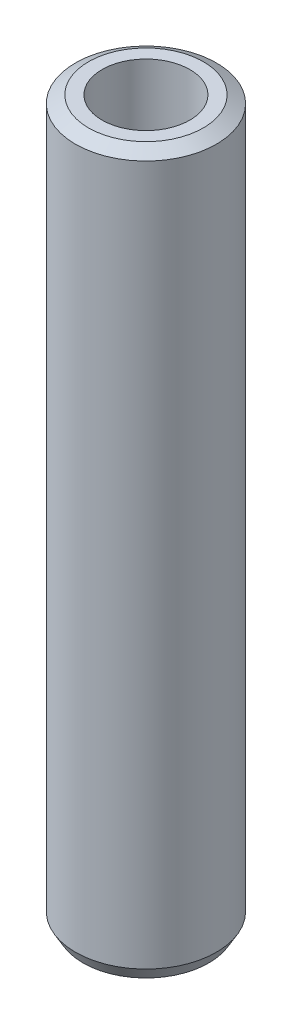
ISO-10303-21;
HEADER;
FILE_DESCRIPTION(('STEP AP214'),'2;1');
FILE_NAME('part.step','',(''),(''),'','','');
FILE_SCHEMA(('AUTOMOTIVE_DESIGN { 1 0 10303 214 1 1 1 1 }'));
ENDSEC;
DATA;
#1=APPLICATION_CONTEXT('core data for automotive mechanical design processes');
#2=APPLICATION_PROTOCOL_DEFINITION('international standard','automotive_design',2000,#1);
#3=PRODUCT_CONTEXT('',#1,'mechanical');
#4=PRODUCT('Part','Part','',(#3));
#5=PRODUCT_RELATED_PRODUCT_CATEGORY('part','',(#4));
#6=PRODUCT_DEFINITION_FORMATION('','',#4);
#7=PRODUCT_DEFINITION_CONTEXT('part definition',#1,'design');
#8=PRODUCT_DEFINITION('design','',#6,#7);
#9=PRODUCT_DEFINITION_SHAPE('','',#8);
#10=(LENGTH_UNIT() NAMED_UNIT(*) SI_UNIT(.MILLI.,.METRE.));
#11=(NAMED_UNIT(*) PLANE_ANGLE_UNIT() SI_UNIT($,.RADIAN.));
#12=(NAMED_UNIT(*) SI_UNIT($,.STERADIAN.) SOLID_ANGLE_UNIT());
#13=UNCERTAINTY_MEASURE_WITH_UNIT(LENGTH_MEASURE(1.E-05),#10,'distance_accuracy_value','');
#14=(GEOMETRIC_REPRESENTATION_CONTEXT(3) GLOBAL_UNCERTAINTY_ASSIGNED_CONTEXT((#13)) GLOBAL_UNIT_ASSIGNED_CONTEXT((#10,
#11,#12)) REPRESENTATION_CONTEXT('',''));
#15=CARTESIAN_POINT('',(0.,0.,0.));
#16=DIRECTION('',(0.,0.,1.));
#17=DIRECTION('',(1.,0.,0.));
#18=AXIS2_PLACEMENT_3D('',#15,#16,#17);
#19=CARTESIAN_POINT('',(0.,408.854899427653,0.));
#20=DIRECTION('',(0.,-1.,0.));
#21=DIRECTION('',(0.,0.,-1.));
#22=AXIS2_PLACEMENT_3D('',#19,#20,#21);
#23=CYLINDRICAL_SURFACE('',#22,40.);
#24=CARTESIAN_POINT('',(0.,404.567432855086,0.));
#25=DIRECTION('',(0.,1.,0.));
#26=DIRECTION('',(0.,0.,1.));
#27=AXIS2_PLACEMENT_3D('',#24,#25,#26);
#28=CIRCLE('',#27,40.);
#29=CARTESIAN_POINT('',(0.,404.567432855086,40.));
#30=VERTEX_POINT('',#29);
#31=EDGE_CURVE('E50',#30,#30,#28,.F.);
#32=ORIENTED_EDGE('',*,*,#31,.T.);
#33=EDGE_LOOP('',(#32));
#34=FACE_BOUND('',#33,.T.);
#35=CARTESIAN_POINT('',(0.,7.42610993943815,0.));
#36=DIRECTION('',(0.,1.,0.));
#37=DIRECTION('',(0.,0.,1.));
#38=AXIS2_PLACEMENT_3D('',#35,#36,#37);
#39=CIRCLE('',#38,40.);
#40=CARTESIAN_POINT('',(0.,7.42610993943815,40.));
#41=VERTEX_POINT('',#40);
#42=EDGE_CURVE('E51',#41,#41,#39,.T.);
#43=ORIENTED_EDGE('',*,*,#42,.T.);
#44=EDGE_LOOP('',(#43));
#45=FACE_BOUND('',#44,.T.);
#46=ADVANCED_FACE('F39',(#34,#45),#23,.T.);
#47=CARTESIAN_POINT('',(0.,408.854899427653,0.));
#48=DIRECTION('',(0.,1.,0.));
#49=DIRECTION('',(0.,0.,1.));
#50=AXIS2_PLACEMENT_3D('',#47,#48,#49);
#51=PLANE('',#50);
#52=CARTESIAN_POINT('',(0.,408.854899427653,0.));
#53=DIRECTION('',(0.,1.,0.));
#54=DIRECTION('',(0.,0.,1.));
#55=AXIS2_PLACEMENT_3D('',#52,#53,#54);
#56=CIRCLE('',#55,32.5738900605617);
#57=CARTESIAN_POINT('',(0.,408.854899427653,32.5738900605617));
#58=VERTEX_POINT('',#57);
#59=EDGE_CURVE('E54',#58,#58,#56,.T.);
#60=ORIENTED_EDGE('',*,*,#59,.T.);
#61=EDGE_LOOP('',(#60));
#62=FACE_BOUND('',#61,.T.);
#63=CARTESIAN_POINT('',(0.,408.854899427653,0.));
#64=DIRECTION('',(0.,1.,0.));
#65=DIRECTION('',(0.,0.,1.));
#66=AXIS2_PLACEMENT_3D('',#63,#64,#65);
#67=CIRCLE('',#66,24.9022320106164);
#68=CARTESIAN_POINT('',(0.,408.854899427653,24.9022320106164));
#69=VERTEX_POINT('',#68);
#70=EDGE_CURVE('E58',#69,#69,#67,.T.);
#71=ORIENTED_EDGE('',*,*,#70,.F.);
#72=EDGE_LOOP('',(#71));
#73=FACE_BOUND('',#72,.T.);
#74=ADVANCED_FACE('F69',(#62,#73),#51,.T.);
#75=CARTESIAN_POINT('',(0.,0.,0.));
#76=DIRECTION('',(0.,1.,0.));
#77=DIRECTION('',(0.,0.,1.));
#78=AXIS2_PLACEMENT_3D('',#75,#76,#77);
#79=PLANE('',#78);
#80=CARTESIAN_POINT('',(0.,0.,0.));
#81=DIRECTION('',(0.,1.,0.));
#82=DIRECTION('',(0.,0.,1.));
#83=AXIS2_PLACEMENT_3D('',#80,#81,#82);
#84=CIRCLE('',#83,35.7125334274336);
#85=CARTESIAN_POINT('',(0.,0.,35.7125334274336));
#86=VERTEX_POINT('',#85);
#87=EDGE_CURVE('E10',#86,#86,#84,.F.);
#88=ORIENTED_EDGE('',*,*,#87,.T.);
#89=EDGE_LOOP('',(#88));
#90=FACE_BOUND('',#89,.T.);
#91=CARTESIAN_POINT('',(0.,0.,0.));
#92=DIRECTION('',(0.,1.,0.));
#93=DIRECTION('',(0.,0.,1.));
#94=AXIS2_PLACEMENT_3D('',#91,#92,#93);
#95=CIRCLE('',#94,24.9022320106164);
#96=CARTESIAN_POINT('',(0.,0.,24.9022320106164));
#97=VERTEX_POINT('',#96);
#98=EDGE_CURVE('E63',#97,#97,#95,.T.);
#99=ORIENTED_EDGE('',*,*,#98,.T.);
#100=EDGE_LOOP('',(#99));
#101=FACE_BOUND('',#100,.T.);
#102=ADVANCED_FACE('F75',(#90,#101),#79,.F.);
#103=CARTESIAN_POINT('',(0.,408.854899427653,0.));
#104=DIRECTION('',(0.,-1.,0.));
#105=DIRECTION('',(0.,0.,-1.));
#106=AXIS2_PLACEMENT_3D('',#103,#104,#105);
#107=CYLINDRICAL_SURFACE('',#106,24.9022320106164);
#108=ORIENTED_EDGE('',*,*,#70,.T.);
#109=EDGE_LOOP('',(#108));
#110=FACE_BOUND('',#109,.T.);
#111=ORIENTED_EDGE('',*,*,#98,.F.);
#112=EDGE_LOOP('',(#111));
#113=FACE_BOUND('',#112,.T.);
#114=ADVANCED_FACE('F70',(#110,#113),#107,.F.);
#115=CARTESIAN_POINT('',(0.,408.854899427653,0.));
#116=DIRECTION('',(0.,-1.,0.));
#117=DIRECTION('',(0.,0.,-1.));
#118=AXIS2_PLACEMENT_3D('',#115,#116,#117);
#119=CONICAL_SURFACE('',#118,32.5738900605617,1.04719755119659);
#120=ORIENTED_EDGE('',*,*,#31,.F.);
#121=EDGE_LOOP('',(#120));
#122=FACE_BOUND('',#121,.T.);
#123=ORIENTED_EDGE('',*,*,#59,.F.);
#124=EDGE_LOOP('',(#123));
#125=FACE_BOUND('',#124,.T.);
#126=ADVANCED_FACE('F81',(#122,#125),#119,.T.);
#127=CARTESIAN_POINT('',(0.,7.42610993943815,0.));
#128=DIRECTION('',(0.,1.,0.));
#129=DIRECTION('',(0.,0.,1.));
#130=AXIS2_PLACEMENT_3D('',#127,#128,#129);
#131=CONICAL_SURFACE('',#130,40.,0.523598775598304);
#132=ORIENTED_EDGE('',*,*,#87,.F.);
#133=EDGE_LOOP('',(#132));
#134=FACE_BOUND('',#133,.T.);
#135=ORIENTED_EDGE('',*,*,#42,.F.);
#136=EDGE_LOOP('',(#135));
#137=FACE_BOUND('',#136,.T.);
#138=ADVANCED_FACE('F45',(#134,#137),#131,.T.);
#139=CLOSED_SHELL('',(#46,#74,#102,#114,#126,#138));
#140=MANIFOLD_SOLID_BREP('B2',#139);
#141=ADVANCED_BREP_SHAPE_REPRESENTATION('',(#18,#140),#14);
#142=SHAPE_DEFINITION_REPRESENTATION(#9,#141);
ENDSEC;
END-ISO-10303-21;
